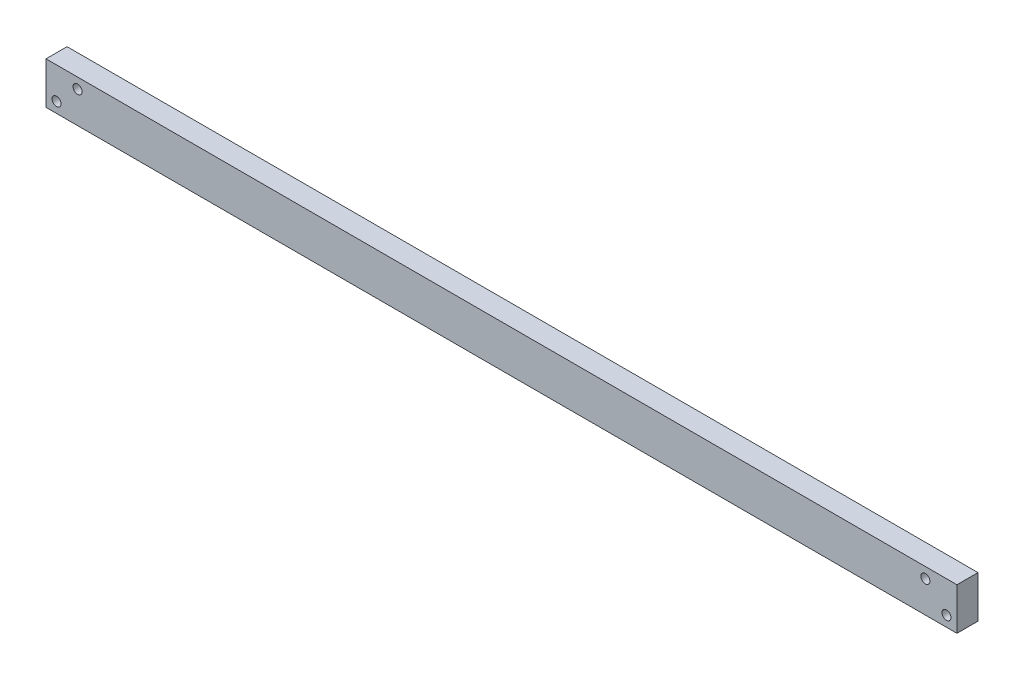
ISO-10303-21;
HEADER;
FILE_DESCRIPTION(('STEP AP214'),'2;1');
FILE_NAME('part.step','',(''),(''),'','','');
FILE_SCHEMA(('AUTOMOTIVE_DESIGN { 1 0 10303 214 1 1 1 1 }'));
ENDSEC;
DATA;
#1=APPLICATION_CONTEXT('core data for automotive mechanical design processes');
#2=APPLICATION_PROTOCOL_DEFINITION('international standard','automotive_design',2000,#1);
#3=PRODUCT_CONTEXT('',#1,'mechanical');
#4=PRODUCT('Part','Part','',(#3));
#5=PRODUCT_RELATED_PRODUCT_CATEGORY('part','',(#4));
#6=PRODUCT_DEFINITION_FORMATION('','',#4);
#7=PRODUCT_DEFINITION_CONTEXT('part definition',#1,'design');
#8=PRODUCT_DEFINITION('design','',#6,#7);
#9=PRODUCT_DEFINITION_SHAPE('','',#8);
#10=(LENGTH_UNIT() NAMED_UNIT(*) SI_UNIT(.MILLI.,.METRE.));
#11=(NAMED_UNIT(*) PLANE_ANGLE_UNIT() SI_UNIT($,.RADIAN.));
#12=(NAMED_UNIT(*) SI_UNIT($,.STERADIAN.) SOLID_ANGLE_UNIT());
#13=UNCERTAINTY_MEASURE_WITH_UNIT(LENGTH_MEASURE(1.E-05),#10,'distance_accuracy_value','');
#14=(GEOMETRIC_REPRESENTATION_CONTEXT(3) GLOBAL_UNCERTAINTY_ASSIGNED_CONTEXT((#13)) GLOBAL_UNIT_ASSIGNED_CONTEXT((#10,
#11,#12)) REPRESENTATION_CONTEXT('',''));
#15=CARTESIAN_POINT('',(0.,0.,0.));
#16=DIRECTION('',(0.,0.,1.));
#17=DIRECTION('',(1.,0.,0.));
#18=AXIS2_PLACEMENT_3D('',#15,#16,#17);
#19=CARTESIAN_POINT('',(303.,-14.,14.));
#20=DIRECTION('',(-1.,0.,0.));
#21=DIRECTION('',(0.,0.,1.));
#22=AXIS2_PLACEMENT_3D('',#19,#20,#21);
#23=PLANE('',#22);
#24=DIRECTION('',(0.,1.,0.));
#25=VECTOR('',#24,1.);
#26=CARTESIAN_POINT('',(303.,-14.,0.));
#27=LINE('',#26,#25);
#28=CARTESIAN_POINT('',(303.,-14.,0.));
#29=VERTEX_POINT('',#28);
#30=CARTESIAN_POINT('',(303.,14.,0.));
#31=VERTEX_POINT('',#30);
#32=EDGE_CURVE('E96',#29,#31,#27,.T.);
#33=ORIENTED_EDGE('',*,*,#32,.T.);
#34=DIRECTION('',(0.,0.,-1.));
#35=VECTOR('',#34,1.);
#36=CARTESIAN_POINT('',(303.,14.,14.));
#37=LINE('',#36,#35);
#38=CARTESIAN_POINT('',(303.,14.,14.));
#39=VERTEX_POINT('',#38);
#40=EDGE_CURVE('E11',#39,#31,#37,.T.);
#41=ORIENTED_EDGE('',*,*,#40,.F.);
#42=DIRECTION('',(0.,1.,0.));
#43=VECTOR('',#42,1.);
#44=CARTESIAN_POINT('',(303.,-14.,14.));
#45=LINE('',#44,#43);
#46=CARTESIAN_POINT('',(303.,-14.,14.));
#47=VERTEX_POINT('',#46);
#48=EDGE_CURVE('E84',#47,#39,#45,.T.);
#49=ORIENTED_EDGE('',*,*,#48,.F.);
#50=DIRECTION('',(0.,0.,-1.));
#51=VECTOR('',#50,1.);
#52=CARTESIAN_POINT('',(303.,-14.,14.));
#53=LINE('',#52,#51);
#54=EDGE_CURVE('E92',#47,#29,#53,.T.);
#55=ORIENTED_EDGE('',*,*,#54,.T.);
#56=EDGE_LOOP('',(#33,#41,#49,#55));
#57=FACE_BOUND('',#56,.T.);
#58=ADVANCED_FACE('F33',(#57),#23,.F.);
#59=CARTESIAN_POINT('',(-303.,14.,14.));
#60=DIRECTION('',(0.,-1.,0.));
#61=DIRECTION('',(0.,0.,-1.));
#62=AXIS2_PLACEMENT_3D('',#59,#60,#61);
#63=PLANE('',#62);
#64=DIRECTION('',(-1.,0.,0.));
#65=VECTOR('',#64,1.);
#66=CARTESIAN_POINT('',(-303.,14.,0.));
#67=LINE('',#66,#65);
#68=CARTESIAN_POINT('',(-303.,14.,0.));
#69=VERTEX_POINT('',#68);
#70=EDGE_CURVE('E88',#31,#69,#67,.T.);
#71=ORIENTED_EDGE('',*,*,#70,.T.);
#72=DIRECTION('',(0.,0.,-1.));
#73=VECTOR('',#72,1.);
#74=CARTESIAN_POINT('',(-303.,14.,14.));
#75=LINE('',#74,#73);
#76=CARTESIAN_POINT('',(-303.,14.,14.));
#77=VERTEX_POINT('',#76);
#78=EDGE_CURVE('E41',#77,#69,#75,.T.);
#79=ORIENTED_EDGE('',*,*,#78,.F.);
#80=DIRECTION('',(-1.,0.,0.));
#81=VECTOR('',#80,1.);
#82=CARTESIAN_POINT('',(-303.,14.,14.));
#83=LINE('',#82,#81);
#84=EDGE_CURVE('E79',#39,#77,#83,.T.);
#85=ORIENTED_EDGE('',*,*,#84,.F.);
#86=ORIENTED_EDGE('',*,*,#40,.T.);
#87=EDGE_LOOP('',(#71,#79,#85,#86));
#88=FACE_BOUND('',#87,.T.);
#89=ADVANCED_FACE('F87',(#88),#63,.F.);
#90=CARTESIAN_POINT('',(-303.,-14.,14.));
#91=DIRECTION('',(1.,0.,0.));
#92=DIRECTION('',(0.,0.,-1.));
#93=AXIS2_PLACEMENT_3D('',#90,#91,#92);
#94=PLANE('',#93);
#95=DIRECTION('',(0.,-1.,0.));
#96=VECTOR('',#95,1.);
#97=CARTESIAN_POINT('',(-303.,-14.,0.));
#98=LINE('',#97,#96);
#99=CARTESIAN_POINT('',(-303.,-14.,0.));
#100=VERTEX_POINT('',#99);
#101=EDGE_CURVE('E66',#69,#100,#98,.T.);
#102=ORIENTED_EDGE('',*,*,#101,.T.);
#103=DIRECTION('',(0.,0.,-1.));
#104=VECTOR('',#103,1.);
#105=CARTESIAN_POINT('',(-303.,-14.,14.));
#106=LINE('',#105,#104);
#107=CARTESIAN_POINT('',(-303.,-14.,14.));
#108=VERTEX_POINT('',#107);
#109=EDGE_CURVE('E89',#108,#100,#106,.T.);
#110=ORIENTED_EDGE('',*,*,#109,.F.);
#111=DIRECTION('',(0.,-1.,0.));
#112=VECTOR('',#111,1.);
#113=CARTESIAN_POINT('',(-303.,-14.,14.));
#114=LINE('',#113,#112);
#115=EDGE_CURVE('E82',#77,#108,#114,.T.);
#116=ORIENTED_EDGE('',*,*,#115,.F.);
#117=ORIENTED_EDGE('',*,*,#78,.T.);
#118=EDGE_LOOP('',(#102,#110,#116,#117));
#119=FACE_BOUND('',#118,.T.);
#120=ADVANCED_FACE('F90',(#119),#94,.F.);
#121=CARTESIAN_POINT('',(-303.,-14.,14.));
#122=DIRECTION('',(0.,1.,0.));
#123=DIRECTION('',(0.,0.,1.));
#124=AXIS2_PLACEMENT_3D('',#121,#122,#123);
#125=PLANE('',#124);
#126=DIRECTION('',(1.,0.,0.));
#127=VECTOR('',#126,1.);
#128=CARTESIAN_POINT('',(-303.,-14.,0.));
#129=LINE('',#128,#127);
#130=EDGE_CURVE('E72',#100,#29,#129,.T.);
#131=ORIENTED_EDGE('',*,*,#130,.T.);
#132=ORIENTED_EDGE('',*,*,#54,.F.);
#133=DIRECTION('',(1.,0.,0.));
#134=VECTOR('',#133,1.);
#135=CARTESIAN_POINT('',(-303.,-14.,14.));
#136=LINE('',#135,#134);
#137=EDGE_CURVE('E49',#108,#47,#136,.T.);
#138=ORIENTED_EDGE('',*,*,#137,.F.);
#139=ORIENTED_EDGE('',*,*,#109,.T.);
#140=EDGE_LOOP('',(#131,#132,#138,#139));
#141=FACE_BOUND('',#140,.T.);
#142=ADVANCED_FACE('F104',(#141),#125,.F.);
#143=CARTESIAN_POINT('',(0.,0.,14.));
#144=DIRECTION('',(0.,0.,-1.));
#145=DIRECTION('',(-1.,0.,0.));
#146=AXIS2_PLACEMENT_3D('',#143,#144,#145);
#147=PLANE('',#146);
#148=CARTESIAN_POINT('',(282.,6.9999999999999,14.));
#149=DIRECTION('',(0.,0.,1.));
#150=DIRECTION('',(-1.,0.,0.));
#151=AXIS2_PLACEMENT_3D('',#148,#149,#150);
#152=CIRCLE('',#151,2.99999999999999);
#153=CARTESIAN_POINT('',(279.,6.9999999999999,14.));
#154=VERTEX_POINT('',#153);
#155=EDGE_CURVE('E119',#154,#154,#152,.T.);
#156=ORIENTED_EDGE('',*,*,#155,.F.);
#157=EDGE_LOOP('',(#156));
#158=FACE_BOUND('',#157,.T.);
#159=CARTESIAN_POINT('',(296.,-7.00000000000008,14.));
#160=DIRECTION('',(0.,0.,1.));
#161=DIRECTION('',(-1.,0.,0.));
#162=AXIS2_PLACEMENT_3D('',#159,#160,#161);
#163=CIRCLE('',#162,2.99999999999999);
#164=CARTESIAN_POINT('',(293.,-7.00000000000008,14.));
#165=VERTEX_POINT('',#164);
#166=EDGE_CURVE('E125',#165,#165,#163,.T.);
#167=ORIENTED_EDGE('',*,*,#166,.F.);
#168=EDGE_LOOP('',(#167));
#169=FACE_BOUND('',#168,.T.);
#170=CARTESIAN_POINT('',(-296.,-7.00000000000003,14.));
#171=DIRECTION('',(0.,0.,1.));
#172=DIRECTION('',(1.,0.,0.));
#173=AXIS2_PLACEMENT_3D('',#170,#171,#172);
#174=CIRCLE('',#173,2.99999999999999);
#175=CARTESIAN_POINT('',(-293.,-7.00000000000003,14.));
#176=VERTEX_POINT('',#175);
#177=EDGE_CURVE('E113',#176,#176,#174,.T.);
#178=ORIENTED_EDGE('',*,*,#177,.F.);
#179=EDGE_LOOP('',(#178));
#180=FACE_BOUND('',#179,.T.);
#181=CARTESIAN_POINT('',(-282.,6.99999999999997,14.));
#182=DIRECTION('',(0.,0.,1.));
#183=DIRECTION('',(1.,0.,0.));
#184=AXIS2_PLACEMENT_3D('',#181,#182,#183);
#185=CIRCLE('',#184,2.99999999999999);
#186=CARTESIAN_POINT('',(-279.,6.99999999999997,14.));
#187=VERTEX_POINT('',#186);
#188=EDGE_CURVE('E99',#187,#187,#185,.T.);
#189=ORIENTED_EDGE('',*,*,#188,.F.);
#190=EDGE_LOOP('',(#189));
#191=FACE_BOUND('',#190,.T.);
#192=ORIENTED_EDGE('',*,*,#48,.T.);
#193=ORIENTED_EDGE('',*,*,#84,.T.);
#194=ORIENTED_EDGE('',*,*,#115,.T.);
#195=ORIENTED_EDGE('',*,*,#137,.T.);
#196=EDGE_LOOP('',(#192,#193,#194,#195));
#197=FACE_BOUND('',#196,.T.);
#198=ADVANCED_FACE('F80',(#158,#169,#180,#191,#197),#147,.F.);
#199=CARTESIAN_POINT('',(0.,0.,0.));
#200=DIRECTION('',(0.,0.,-1.));
#201=DIRECTION('',(-1.,0.,0.));
#202=AXIS2_PLACEMENT_3D('',#199,#200,#201);
#203=PLANE('',#202);
#204=CARTESIAN_POINT('',(282.,6.9999999999999,0.));
#205=DIRECTION('',(0.,0.,-1.));
#206=DIRECTION('',(-1.,0.,0.));
#207=AXIS2_PLACEMENT_3D('',#204,#205,#206);
#208=CIRCLE('',#207,2.99999999999999);
#209=CARTESIAN_POINT('',(279.,6.9999999999999,0.));
#210=VERTEX_POINT('',#209);
#211=EDGE_CURVE('E116',#210,#210,#208,.F.);
#212=ORIENTED_EDGE('',*,*,#211,.T.);
#213=EDGE_LOOP('',(#212));
#214=FACE_BOUND('',#213,.T.);
#215=CARTESIAN_POINT('',(296.,-7.00000000000008,0.));
#216=DIRECTION('',(0.,0.,-1.));
#217=DIRECTION('',(-1.,0.,0.));
#218=AXIS2_PLACEMENT_3D('',#215,#216,#217);
#219=CIRCLE('',#218,2.99999999999999);
#220=CARTESIAN_POINT('',(293.,-7.00000000000008,0.));
#221=VERTEX_POINT('',#220);
#222=EDGE_CURVE('E122',#221,#221,#219,.F.);
#223=ORIENTED_EDGE('',*,*,#222,.T.);
#224=EDGE_LOOP('',(#223));
#225=FACE_BOUND('',#224,.T.);
#226=CARTESIAN_POINT('',(-296.,-7.00000000000003,0.));
#227=DIRECTION('',(0.,0.,-1.));
#228=DIRECTION('',(-1.,0.,0.));
#229=AXIS2_PLACEMENT_3D('',#226,#227,#228);
#230=CIRCLE('',#229,2.99999999999999);
#231=CARTESIAN_POINT('',(-299.,-7.00000000000003,0.));
#232=VERTEX_POINT('',#231);
#233=EDGE_CURVE('E128',#232,#232,#230,.F.);
#234=ORIENTED_EDGE('',*,*,#233,.T.);
#235=EDGE_LOOP('',(#234));
#236=FACE_BOUND('',#235,.T.);
#237=CARTESIAN_POINT('',(-282.,6.99999999999997,0.));
#238=DIRECTION('',(0.,0.,-1.));
#239=DIRECTION('',(-1.,0.,0.));
#240=AXIS2_PLACEMENT_3D('',#237,#238,#239);
#241=CIRCLE('',#240,2.99999999999999);
#242=CARTESIAN_POINT('',(-285.,6.99999999999997,0.));
#243=VERTEX_POINT('',#242);
#244=EDGE_CURVE('E110',#243,#243,#241,.F.);
#245=ORIENTED_EDGE('',*,*,#244,.T.);
#246=EDGE_LOOP('',(#245));
#247=FACE_BOUND('',#246,.T.);
#248=ORIENTED_EDGE('',*,*,#32,.F.);
#249=ORIENTED_EDGE('',*,*,#130,.F.);
#250=ORIENTED_EDGE('',*,*,#101,.F.);
#251=ORIENTED_EDGE('',*,*,#70,.F.);
#252=EDGE_LOOP('',(#248,#249,#250,#251));
#253=FACE_BOUND('',#252,.T.);
#254=ADVANCED_FACE('F107',(#214,#225,#236,#247,#253),#203,.T.);
#255=CARTESIAN_POINT('',(-282.,6.99999999999997,-0.000999999999999265));
#256=DIRECTION('',(0.,0.,1.));
#257=DIRECTION('',(1.,0.,0.));
#258=AXIS2_PLACEMENT_3D('',#255,#256,#257);
#259=CYLINDRICAL_SURFACE('',#258,2.99999999999999);
#260=ORIENTED_EDGE('',*,*,#244,.F.);
#261=EDGE_LOOP('',(#260));
#262=FACE_BOUND('',#261,.T.);
#263=ORIENTED_EDGE('',*,*,#188,.T.);
#264=EDGE_LOOP('',(#263));
#265=FACE_BOUND('',#264,.T.);
#266=ADVANCED_FACE('F142',(#262,#265),#259,.F.);
#267=CARTESIAN_POINT('',(-296.,-7.00000000000003,-0.000999999999999265));
#268=DIRECTION('',(0.,0.,1.));
#269=DIRECTION('',(1.,0.,0.));
#270=AXIS2_PLACEMENT_3D('',#267,#268,#269);
#271=CYLINDRICAL_SURFACE('',#270,2.99999999999999);
#272=ORIENTED_EDGE('',*,*,#233,.F.);
#273=EDGE_LOOP('',(#272));
#274=FACE_BOUND('',#273,.T.);
#275=ORIENTED_EDGE('',*,*,#177,.T.);
#276=EDGE_LOOP('',(#275));
#277=FACE_BOUND('',#276,.T.);
#278=ADVANCED_FACE('F134',(#274,#277),#271,.F.);
#279=CARTESIAN_POINT('',(296.,-7.00000000000008,-0.000999999999999265));
#280=DIRECTION('',(0.,0.,1.));
#281=DIRECTION('',(1.,0.,0.));
#282=AXIS2_PLACEMENT_3D('',#279,#280,#281);
#283=CYLINDRICAL_SURFACE('',#282,2.99999999999999);
#284=ORIENTED_EDGE('',*,*,#222,.F.);
#285=EDGE_LOOP('',(#284));
#286=FACE_BOUND('',#285,.T.);
#287=ORIENTED_EDGE('',*,*,#166,.T.);
#288=EDGE_LOOP('',(#287));
#289=FACE_BOUND('',#288,.T.);
#290=ADVANCED_FACE('F150',(#286,#289),#283,.F.);
#291=CARTESIAN_POINT('',(282.,6.9999999999999,-0.000999999999999265));
#292=DIRECTION('',(0.,0.,1.));
#293=DIRECTION('',(1.,0.,0.));
#294=AXIS2_PLACEMENT_3D('',#291,#292,#293);
#295=CYLINDRICAL_SURFACE('',#294,2.99999999999999);
#296=ORIENTED_EDGE('',*,*,#211,.F.);
#297=EDGE_LOOP('',(#296));
#298=FACE_BOUND('',#297,.T.);
#299=ORIENTED_EDGE('',*,*,#155,.T.);
#300=EDGE_LOOP('',(#299));
#301=FACE_BOUND('',#300,.T.);
#302=ADVANCED_FACE('F198',(#298,#301),#295,.F.);
#303=CLOSED_SHELL('',(#58,#89,#120,#142,#198,#254,#266,#278,#290,#302));
#304=MANIFOLD_SOLID_BREP('B2',#303);
#305=ADVANCED_BREP_SHAPE_REPRESENTATION('',(#18,#304),#14);
#306=SHAPE_DEFINITION_REPRESENTATION(#9,#305);
ENDSEC;
END-ISO-10303-21;
